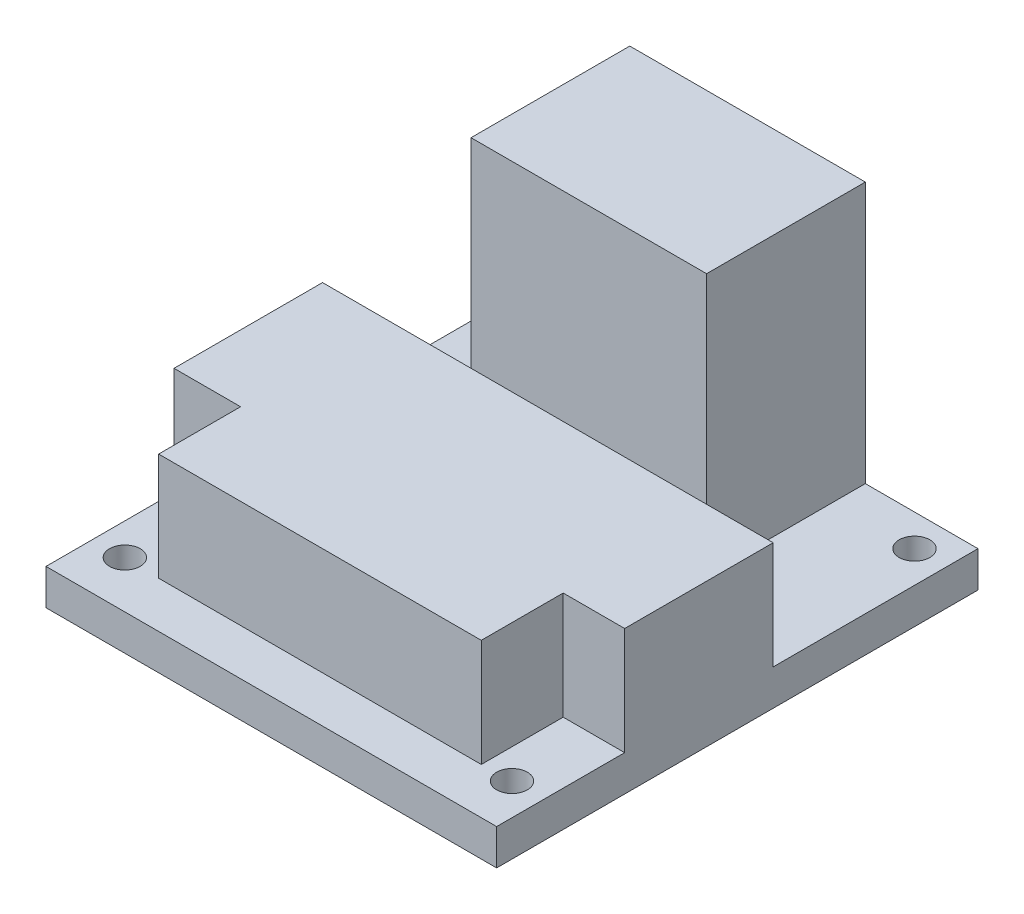
ISO-10303-21;
HEADER;
FILE_DESCRIPTION(('STEP AP214'),'2;1');
FILE_NAME('part.step','',(''),(''),'','','');
FILE_SCHEMA(('AUTOMOTIVE_DESIGN { 1 0 10303 214 1 1 1 1 }'));
ENDSEC;
DATA;
#1=APPLICATION_CONTEXT('core data for automotive mechanical design processes');
#2=APPLICATION_PROTOCOL_DEFINITION('international standard','automotive_design',2000,#1);
#3=PRODUCT_CONTEXT('',#1,'mechanical');
#4=PRODUCT('Part','Part','',(#3));
#5=PRODUCT_RELATED_PRODUCT_CATEGORY('part','',(#4));
#6=PRODUCT_DEFINITION_FORMATION('','',#4);
#7=PRODUCT_DEFINITION_CONTEXT('part definition',#1,'design');
#8=PRODUCT_DEFINITION('design','',#6,#7);
#9=PRODUCT_DEFINITION_SHAPE('','',#8);
#10=(LENGTH_UNIT() NAMED_UNIT(*) SI_UNIT(.MILLI.,.METRE.));
#11=(NAMED_UNIT(*) PLANE_ANGLE_UNIT() SI_UNIT($,.RADIAN.));
#12=(NAMED_UNIT(*) SI_UNIT($,.STERADIAN.) SOLID_ANGLE_UNIT());
#13=UNCERTAINTY_MEASURE_WITH_UNIT(LENGTH_MEASURE(1.E-05),#10,'distance_accuracy_value','');
#14=(GEOMETRIC_REPRESENTATION_CONTEXT(3) GLOBAL_UNCERTAINTY_ASSIGNED_CONTEXT((#13)) GLOBAL_UNIT_ASSIGNED_CONTEXT((#10,
#11,#12)) REPRESENTATION_CONTEXT('',''));
#15=CARTESIAN_POINT('',(0.,0.,0.));
#16=DIRECTION('',(0.,0.,1.));
#17=DIRECTION('',(1.,0.,0.));
#18=AXIS2_PLACEMENT_3D('',#15,#16,#17);
#19=CARTESIAN_POINT('',(0.,3.5,0.));
#20=DIRECTION('',(0.,-1.,0.));
#21=DIRECTION('',(0.,0.,-1.));
#22=AXIS2_PLACEMENT_3D('',#19,#20,#21);
#23=PLANE('',#22);
#24=CARTESIAN_POINT('',(40.9,3.5,-43.9));
#25=DIRECTION('',(0.,-1.,0.));
#26=DIRECTION('',(0.,0.,-1.));
#27=AXIS2_PLACEMENT_3D('',#24,#25,#26);
#28=CIRCLE('',#27,1.5);
#29=CARTESIAN_POINT('',(40.9,3.5,-45.4));
#30=VERTEX_POINT('',#29);
#31=EDGE_CURVE('E257',#30,#30,#28,.T.);
#32=ORIENTED_EDGE('',*,*,#31,.T.);
#33=EDGE_LOOP('',(#32));
#34=FACE_BOUND('',#33,.T.);
#35=CARTESIAN_POINT('',(3.09999999999999,3.5,-43.9));
#36=DIRECTION('',(0.,-1.,0.));
#37=DIRECTION('',(0.,0.,-1.));
#38=AXIS2_PLACEMENT_3D('',#35,#36,#37);
#39=CIRCLE('',#38,1.5);
#40=CARTESIAN_POINT('',(3.09999999999999,3.5,-45.4));
#41=VERTEX_POINT('',#40);
#42=EDGE_CURVE('E253',#41,#41,#39,.T.);
#43=ORIENTED_EDGE('',*,*,#42,.T.);
#44=EDGE_LOOP('',(#43));
#45=FACE_BOUND('',#44,.T.);
#46=DIRECTION('',(0.,0.,1.));
#47=VECTOR('',#46,1.);
#48=CARTESIAN_POINT('',(9.99999999999999,3.5,-47.));
#49=LINE('',#48,#47);
#50=CARTESIAN_POINT('',(9.99999999999999,3.5,-47.));
#51=VERTEX_POINT('',#50);
#52=CARTESIAN_POINT('',(9.99999999999999,3.5,-31.5));
#53=VERTEX_POINT('',#52);
#54=EDGE_CURVE('E290',#51,#53,#49,.T.);
#55=ORIENTED_EDGE('',*,*,#54,.F.);
#56=DIRECTION('',(-1.,0.,0.));
#57=VECTOR('',#56,1.);
#58=CARTESIAN_POINT('',(0.,3.5,-47.));
#59=LINE('',#58,#57);
#60=CARTESIAN_POINT('',(0.,3.5,-47.));
#61=VERTEX_POINT('',#60);
#62=EDGE_CURVE('E222',#51,#61,#59,.T.);
#63=ORIENTED_EDGE('',*,*,#62,.T.);
#64=DIRECTION('',(0.,0.,1.));
#65=VECTOR('',#64,1.);
#66=CARTESIAN_POINT('',(0.,3.5,0.));
#67=LINE('',#66,#65);
#68=CARTESIAN_POINT('',(0.,3.5,-27.));
#69=VERTEX_POINT('',#68);
#70=EDGE_CURVE('E211',#61,#69,#67,.T.);
#71=ORIENTED_EDGE('',*,*,#70,.T.);
#72=DIRECTION('',(-1.,0.,0.));
#73=VECTOR('',#72,1.);
#74=CARTESIAN_POINT('',(0.,3.5,-27.));
#75=LINE('',#74,#73);
#76=CARTESIAN_POINT('',(44.,3.5,-27.));
#77=VERTEX_POINT('',#76);
#78=EDGE_CURVE('E187',#77,#69,#75,.T.);
#79=ORIENTED_EDGE('',*,*,#78,.F.);
#80=DIRECTION('',(0.,0.,-1.));
#81=VECTOR('',#80,1.);
#82=CARTESIAN_POINT('',(44.,3.5,0.));
#83=LINE('',#82,#81);
#84=CARTESIAN_POINT('',(44.,3.5,-47.));
#85=VERTEX_POINT('',#84);
#86=EDGE_CURVE('E218',#77,#85,#83,.T.);
#87=ORIENTED_EDGE('',*,*,#86,.T.);
#88=CARTESIAN_POINT('',(33.,3.5,-47.));
#89=VERTEX_POINT('',#88);
#90=EDGE_CURVE('E223',#85,#89,#59,.T.);
#91=ORIENTED_EDGE('',*,*,#90,.T.);
#92=DIRECTION('',(0.,0.,-1.));
#93=VECTOR('',#92,1.);
#94=CARTESIAN_POINT('',(33.,3.5,-47.));
#95=LINE('',#94,#93);
#96=CARTESIAN_POINT('',(33.,3.5,-31.5));
#97=VERTEX_POINT('',#96);
#98=EDGE_CURVE('E316',#97,#89,#95,.T.);
#99=ORIENTED_EDGE('',*,*,#98,.F.);
#100=DIRECTION('',(1.,0.,0.));
#101=VECTOR('',#100,1.);
#102=CARTESIAN_POINT('',(9.99999999999999,3.5,-31.5));
#103=LINE('',#102,#101);
#104=EDGE_CURVE('E329',#53,#97,#103,.T.);
#105=ORIENTED_EDGE('',*,*,#104,.F.);
#106=EDGE_LOOP('',(#55,#63,#71,#79,#87,#91,#99,#105));
#107=FACE_BOUND('',#106,.T.);
#108=ADVANCED_FACE('F45',(#34,#45,#107),#23,.F.);
#109=CARTESIAN_POINT('',(3.09999999999999,3.5,-4.6));
#110=DIRECTION('',(0.,-1.,0.));
#111=DIRECTION('',(0.,0.,-1.));
#112=AXIS2_PLACEMENT_3D('',#109,#110,#111);
#113=CIRCLE('',#112,1.50000000000154);
#114=CARTESIAN_POINT('',(3.09999999999999,3.5,-6.10000000000154));
#115=VERTEX_POINT('',#114);
#116=EDGE_CURVE('E274',#115,#115,#113,.T.);
#117=ORIENTED_EDGE('',*,*,#116,.T.);
#118=EDGE_LOOP('',(#117));
#119=FACE_BOUND('',#118,.T.);
#120=CARTESIAN_POINT('',(40.9,3.5,-4.6));
#121=DIRECTION('',(0.,-1.,0.));
#122=DIRECTION('',(0.,0.,-1.));
#123=AXIS2_PLACEMENT_3D('',#120,#121,#122);
#124=CIRCLE('',#123,1.5);
#125=CARTESIAN_POINT('',(40.9,3.5,-6.1));
#126=VERTEX_POINT('',#125);
#127=EDGE_CURVE('E261',#126,#126,#124,.T.);
#128=ORIENTED_EDGE('',*,*,#127,.T.);
#129=EDGE_LOOP('',(#128));
#130=FACE_BOUND('',#129,.T.);
#131=DIRECTION('',(1.,0.,0.));
#132=VECTOR('',#131,1.);
#133=CARTESIAN_POINT('',(0.,3.5,-4.5));
#134=LINE('',#133,#132);
#135=CARTESIAN_POINT('',(6.5,3.5,-4.5));
#136=VERTEX_POINT('',#135);
#137=CARTESIAN_POINT('',(38.,3.5,-4.5));
#138=VERTEX_POINT('',#137);
#139=EDGE_CURVE('E176',#136,#138,#134,.T.);
#140=ORIENTED_EDGE('',*,*,#139,.F.);
#141=DIRECTION('',(0.,0.,-1.));
#142=VECTOR('',#141,1.);
#143=CARTESIAN_POINT('',(6.5,3.5,-4.5));
#144=LINE('',#143,#142);
#145=CARTESIAN_POINT('',(6.5,3.5,-12.5));
#146=VERTEX_POINT('',#145);
#147=EDGE_CURVE('E161',#136,#146,#144,.T.);
#148=ORIENTED_EDGE('',*,*,#147,.T.);
#149=DIRECTION('',(-1.,0.,0.));
#150=VECTOR('',#149,1.);
#151=CARTESIAN_POINT('',(0.,3.5,-12.5));
#152=LINE('',#151,#150);
#153=CARTESIAN_POINT('',(0.,3.5,-12.5));
#154=VERTEX_POINT('',#153);
#155=EDGE_CURVE('E283',#146,#154,#152,.T.);
#156=ORIENTED_EDGE('',*,*,#155,.T.);
#157=CARTESIAN_POINT('',(0.,3.5,0.));
#158=VERTEX_POINT('',#157);
#159=EDGE_CURVE('E215',#154,#158,#67,.T.);
#160=ORIENTED_EDGE('',*,*,#159,.T.);
#161=DIRECTION('',(1.,0.,0.));
#162=VECTOR('',#161,1.);
#163=CARTESIAN_POINT('',(0.,3.5,0.));
#164=LINE('',#163,#162);
#165=CARTESIAN_POINT('',(44.,3.5,0.));
#166=VERTEX_POINT('',#165);
#167=EDGE_CURVE('E214',#158,#166,#164,.T.);
#168=ORIENTED_EDGE('',*,*,#167,.T.);
#169=CARTESIAN_POINT('',(44.,3.5,-12.5));
#170=VERTEX_POINT('',#169);
#171=EDGE_CURVE('E219',#166,#170,#83,.T.);
#172=ORIENTED_EDGE('',*,*,#171,.T.);
#173=DIRECTION('',(-1.,0.,0.));
#174=VECTOR('',#173,1.);
#175=CARTESIAN_POINT('',(44.,3.5,-12.5));
#176=LINE('',#175,#174);
#177=CARTESIAN_POINT('',(38.,3.5,-12.5));
#178=VERTEX_POINT('',#177);
#179=EDGE_CURVE('E299',#170,#178,#176,.T.);
#180=ORIENTED_EDGE('',*,*,#179,.T.);
#181=DIRECTION('',(0.,0.,1.));
#182=VECTOR('',#181,1.);
#183=CARTESIAN_POINT('',(38.,3.5,-4.5));
#184=LINE('',#183,#182);
#185=EDGE_CURVE('E185',#178,#138,#184,.T.);
#186=ORIENTED_EDGE('',*,*,#185,.T.);
#187=EDGE_LOOP('',(#140,#148,#156,#160,#168,#172,#180,#186));
#188=FACE_BOUND('',#187,.T.);
#189=ADVANCED_FACE('F183',(#119,#130,#188),#23,.F.);
#190=CARTESIAN_POINT('',(0.,3.5,0.));
#191=DIRECTION('',(1.,0.,0.));
#192=DIRECTION('',(0.,0.,-1.));
#193=AXIS2_PLACEMENT_3D('',#190,#191,#192);
#194=PLANE('',#193);
#195=ORIENTED_EDGE('',*,*,#159,.F.);
#196=DIRECTION('',(0.,1.,0.));
#197=VECTOR('',#196,1.);
#198=CARTESIAN_POINT('',(0.,-6.80776406404416,-12.5));
#199=LINE('',#198,#197);
#200=CARTESIAN_POINT('',(0.,14.,-12.5));
#201=VERTEX_POINT('',#200);
#202=EDGE_CURVE('E285',#154,#201,#199,.T.);
#203=ORIENTED_EDGE('',*,*,#202,.T.);
#204=DIRECTION('',(0.,0.,1.));
#205=VECTOR('',#204,1.);
#206=CARTESIAN_POINT('',(0.,14.,-4.5));
#207=LINE('',#206,#205);
#208=CARTESIAN_POINT('',(0.,14.,-27.));
#209=VERTEX_POINT('',#208);
#210=EDGE_CURVE('E193',#209,#201,#207,.T.);
#211=ORIENTED_EDGE('',*,*,#210,.F.);
#212=DIRECTION('',(0.,-1.,0.));
#213=VECTOR('',#212,1.);
#214=CARTESIAN_POINT('',(0.,14.,-27.));
#215=LINE('',#214,#213);
#216=EDGE_CURVE('E202',#209,#69,#215,.T.);
#217=ORIENTED_EDGE('',*,*,#216,.T.);
#218=ORIENTED_EDGE('',*,*,#70,.F.);
#219=DIRECTION('',(0.,-1.,0.));
#220=VECTOR('',#219,1.);
#221=CARTESIAN_POINT('',(0.,3.5,-47.));
#222=LINE('',#221,#220);
#223=CARTESIAN_POINT('',(0.,0.,-47.));
#224=VERTEX_POINT('',#223);
#225=EDGE_CURVE('E226',#61,#224,#222,.T.);
#226=ORIENTED_EDGE('',*,*,#225,.T.);
#227=DIRECTION('',(0.,0.,1.));
#228=VECTOR('',#227,1.);
#229=CARTESIAN_POINT('',(0.,0.,0.));
#230=LINE('',#229,#228);
#231=CARTESIAN_POINT('',(0.,0.,0.));
#232=VERTEX_POINT('',#231);
#233=EDGE_CURVE('E210',#224,#232,#230,.T.);
#234=ORIENTED_EDGE('',*,*,#233,.T.);
#235=DIRECTION('',(0.,-1.,0.));
#236=VECTOR('',#235,1.);
#237=CARTESIAN_POINT('',(0.,3.5,0.));
#238=LINE('',#237,#236);
#239=EDGE_CURVE('E11',#158,#232,#238,.T.);
#240=ORIENTED_EDGE('',*,*,#239,.F.);
#241=EDGE_LOOP('',(#195,#203,#211,#217,#218,#226,#234,#240));
#242=FACE_BOUND('',#241,.T.);
#243=ADVANCED_FACE('F47',(#242),#194,.F.);
#244=CARTESIAN_POINT('',(0.,3.5,0.));
#245=DIRECTION('',(0.,0.,-1.));
#246=DIRECTION('',(-1.,0.,0.));
#247=AXIS2_PLACEMENT_3D('',#244,#245,#246);
#248=PLANE('',#247);
#249=DIRECTION('',(1.,0.,0.));
#250=VECTOR('',#249,1.);
#251=CARTESIAN_POINT('',(0.,0.,0.));
#252=LINE('',#251,#250);
#253=CARTESIAN_POINT('',(44.,0.,0.));
#254=VERTEX_POINT('',#253);
#255=EDGE_CURVE('E230',#232,#254,#252,.T.);
#256=ORIENTED_EDGE('',*,*,#255,.T.);
#257=DIRECTION('',(0.,-1.,0.));
#258=VECTOR('',#257,1.);
#259=CARTESIAN_POINT('',(44.,3.5,0.));
#260=LINE('',#259,#258);
#261=EDGE_CURVE('E55',#166,#254,#260,.T.);
#262=ORIENTED_EDGE('',*,*,#261,.F.);
#263=ORIENTED_EDGE('',*,*,#167,.F.);
#264=ORIENTED_EDGE('',*,*,#239,.T.);
#265=EDGE_LOOP('',(#256,#262,#263,#264));
#266=FACE_BOUND('',#265,.T.);
#267=ADVANCED_FACE('F373',(#266),#248,.F.);
#268=CARTESIAN_POINT('',(44.,3.5,0.));
#269=DIRECTION('',(-1.,0.,0.));
#270=DIRECTION('',(0.,0.,1.));
#271=AXIS2_PLACEMENT_3D('',#268,#269,#270);
#272=PLANE('',#271);
#273=DIRECTION('',(0.,1.,0.));
#274=VECTOR('',#273,1.);
#275=CARTESIAN_POINT('',(44.,-6.80776406404416,-12.5));
#276=LINE('',#275,#274);
#277=CARTESIAN_POINT('',(44.,14.,-12.5));
#278=VERTEX_POINT('',#277);
#279=EDGE_CURVE('E278',#170,#278,#276,.T.);
#280=ORIENTED_EDGE('',*,*,#279,.F.);
#281=ORIENTED_EDGE('',*,*,#171,.F.);
#282=ORIENTED_EDGE('',*,*,#261,.T.);
#283=DIRECTION('',(0.,0.,-1.));
#284=VECTOR('',#283,1.);
#285=CARTESIAN_POINT('',(44.,0.,0.));
#286=LINE('',#285,#284);
#287=CARTESIAN_POINT('',(44.,0.,-47.));
#288=VERTEX_POINT('',#287);
#289=EDGE_CURVE('E233',#254,#288,#286,.T.);
#290=ORIENTED_EDGE('',*,*,#289,.T.);
#291=DIRECTION('',(0.,-1.,0.));
#292=VECTOR('',#291,1.);
#293=CARTESIAN_POINT('',(44.,3.5,-47.));
#294=LINE('',#293,#292);
#295=EDGE_CURVE('E242',#85,#288,#294,.T.);
#296=ORIENTED_EDGE('',*,*,#295,.F.);
#297=ORIENTED_EDGE('',*,*,#86,.F.);
#298=DIRECTION('',(0.,-1.,0.));
#299=VECTOR('',#298,1.);
#300=CARTESIAN_POINT('',(44.,14.,-27.));
#301=LINE('',#300,#299);
#302=CARTESIAN_POINT('',(44.,14.,-27.));
#303=VERTEX_POINT('',#302);
#304=EDGE_CURVE('E206',#303,#77,#301,.T.);
#305=ORIENTED_EDGE('',*,*,#304,.F.);
#306=DIRECTION('',(0.,0.,-1.));
#307=VECTOR('',#306,1.);
#308=CARTESIAN_POINT('',(44.,14.,-4.5));
#309=LINE('',#308,#307);
#310=EDGE_CURVE('E350',#278,#303,#309,.T.);
#311=ORIENTED_EDGE('',*,*,#310,.F.);
#312=EDGE_LOOP('',(#280,#281,#282,#290,#296,#297,#305,#311));
#313=FACE_BOUND('',#312,.T.);
#314=ADVANCED_FACE('F383',(#313),#272,.F.);
#315=CARTESIAN_POINT('',(0.,3.5,-47.));
#316=DIRECTION('',(0.,0.,1.));
#317=DIRECTION('',(1.,0.,0.));
#318=AXIS2_PLACEMENT_3D('',#315,#316,#317);
#319=PLANE('',#318);
#320=DIRECTION('',(-1.,0.,0.));
#321=VECTOR('',#320,1.);
#322=CARTESIAN_POINT('',(0.,0.,-47.));
#323=LINE('',#322,#321);
#324=EDGE_CURVE('E236',#288,#224,#323,.T.);
#325=ORIENTED_EDGE('',*,*,#324,.T.);
#326=ORIENTED_EDGE('',*,*,#225,.F.);
#327=ORIENTED_EDGE('',*,*,#62,.F.);
#328=DIRECTION('',(0.,-1.,0.));
#329=VECTOR('',#328,1.);
#330=CARTESIAN_POINT('',(9.99999999999999,29.,-47.));
#331=LINE('',#330,#329);
#332=CARTESIAN_POINT('',(9.99999999999999,29.,-47.));
#333=VERTEX_POINT('',#332);
#334=EDGE_CURVE('E325',#333,#51,#331,.T.);
#335=ORIENTED_EDGE('',*,*,#334,.F.);
#336=DIRECTION('',(-1.,0.,0.));
#337=VECTOR('',#336,1.);
#338=CARTESIAN_POINT('',(9.99999999999999,29.,-47.));
#339=LINE('',#338,#337);
#340=CARTESIAN_POINT('',(33.,29.,-47.));
#341=VERTEX_POINT('',#340);
#342=EDGE_CURVE('E322',#341,#333,#339,.T.);
#343=ORIENTED_EDGE('',*,*,#342,.F.);
#344=DIRECTION('',(0.,-1.,0.));
#345=VECTOR('',#344,1.);
#346=CARTESIAN_POINT('',(33.,29.,-47.));
#347=LINE('',#346,#345);
#348=EDGE_CURVE('E339',#341,#89,#347,.T.);
#349=ORIENTED_EDGE('',*,*,#348,.T.);
#350=ORIENTED_EDGE('',*,*,#90,.F.);
#351=ORIENTED_EDGE('',*,*,#295,.T.);
#352=EDGE_LOOP('',(#325,#326,#327,#335,#343,#349,#350,#351));
#353=FACE_BOUND('',#352,.T.);
#354=ADVANCED_FACE('F398',(#353),#319,.F.);
#355=CARTESIAN_POINT('',(0.,0.,0.));
#356=DIRECTION('',(0.,-1.,0.));
#357=DIRECTION('',(0.,0.,-1.));
#358=AXIS2_PLACEMENT_3D('',#355,#356,#357);
#359=PLANE('',#358);
#360=CARTESIAN_POINT('',(3.09999999999999,0.,-4.6));
#361=DIRECTION('',(0.,-1.,0.));
#362=DIRECTION('',(0.,0.,-1.));
#363=AXIS2_PLACEMENT_3D('',#360,#361,#362);
#364=CIRCLE('',#363,1.50000000000154);
#365=CARTESIAN_POINT('',(3.09999999999999,0.,-6.10000000000154));
#366=VERTEX_POINT('',#365);
#367=EDGE_CURVE('E49',#366,#366,#364,.T.);
#368=ORIENTED_EDGE('',*,*,#367,.F.);
#369=EDGE_LOOP('',(#368));
#370=FACE_BOUND('',#369,.T.);
#371=CARTESIAN_POINT('',(40.9,0.,-4.6));
#372=DIRECTION('',(0.,-1.,0.));
#373=DIRECTION('',(0.,0.,-1.));
#374=AXIS2_PLACEMENT_3D('',#371,#372,#373);
#375=CIRCLE('',#374,1.5);
#376=CARTESIAN_POINT('',(40.9,0.,-6.1));
#377=VERTEX_POINT('',#376);
#378=EDGE_CURVE('E258',#377,#377,#375,.T.);
#379=ORIENTED_EDGE('',*,*,#378,.F.);
#380=EDGE_LOOP('',(#379));
#381=FACE_BOUND('',#380,.T.);
#382=CARTESIAN_POINT('',(40.9,0.,-43.9));
#383=DIRECTION('',(0.,-1.,0.));
#384=DIRECTION('',(0.,0.,-1.));
#385=AXIS2_PLACEMENT_3D('',#382,#383,#384);
#386=CIRCLE('',#385,1.5);
#387=CARTESIAN_POINT('',(40.9,0.,-45.4));
#388=VERTEX_POINT('',#387);
#389=EDGE_CURVE('E254',#388,#388,#386,.T.);
#390=ORIENTED_EDGE('',*,*,#389,.F.);
#391=EDGE_LOOP('',(#390));
#392=FACE_BOUND('',#391,.T.);
#393=CARTESIAN_POINT('',(3.09999999999999,0.,-43.9));
#394=DIRECTION('',(0.,-1.,0.));
#395=DIRECTION('',(0.,0.,-1.));
#396=AXIS2_PLACEMENT_3D('',#393,#394,#395);
#397=CIRCLE('',#396,1.5);
#398=CARTESIAN_POINT('',(3.09999999999999,0.,-45.4));
#399=VERTEX_POINT('',#398);
#400=EDGE_CURVE('E249',#399,#399,#397,.T.);
#401=ORIENTED_EDGE('',*,*,#400,.F.);
#402=EDGE_LOOP('',(#401));
#403=FACE_BOUND('',#402,.T.);
#404=ORIENTED_EDGE('',*,*,#233,.F.);
#405=ORIENTED_EDGE('',*,*,#324,.F.);
#406=ORIENTED_EDGE('',*,*,#289,.F.);
#407=ORIENTED_EDGE('',*,*,#255,.F.);
#408=EDGE_LOOP('',(#404,#405,#406,#407));
#409=FACE_BOUND('',#408,.T.);
#410=ADVANCED_FACE('F379',(#370,#381,#392,#403,#409),#359,.T.);
#411=CARTESIAN_POINT('',(0.,14.,-4.5));
#412=DIRECTION('',(0.,0.,-1.));
#413=DIRECTION('',(-1.,0.,0.));
#414=AXIS2_PLACEMENT_3D('',#411,#412,#413);
#415=PLANE('',#414);
#416=DIRECTION('',(1.,0.,0.));
#417=VECTOR('',#416,1.);
#418=CARTESIAN_POINT('',(0.,14.,-4.5));
#419=LINE('',#418,#417);
#420=CARTESIAN_POINT('',(6.5,14.,-4.5));
#421=VERTEX_POINT('',#420);
#422=CARTESIAN_POINT('',(38.,14.,-4.5));
#423=VERTEX_POINT('',#422);
#424=EDGE_CURVE('E178',#421,#423,#419,.T.);
#425=ORIENTED_EDGE('',*,*,#424,.F.);
#426=DIRECTION('',(0.,1.,0.));
#427=VECTOR('',#426,1.);
#428=CARTESIAN_POINT('',(6.5,-6.80776406404416,-4.5));
#429=LINE('',#428,#427);
#430=EDGE_CURVE('E164',#136,#421,#429,.T.);
#431=ORIENTED_EDGE('',*,*,#430,.F.);
#432=ORIENTED_EDGE('',*,*,#139,.T.);
#433=DIRECTION('',(0.,1.,0.));
#434=VECTOR('',#433,1.);
#435=CARTESIAN_POINT('',(38.,-6.80776406404416,-4.5));
#436=LINE('',#435,#434);
#437=EDGE_CURVE('E295',#138,#423,#436,.T.);
#438=ORIENTED_EDGE('',*,*,#437,.T.);
#439=EDGE_LOOP('',(#425,#431,#432,#438));
#440=FACE_BOUND('',#439,.T.);
#441=ADVANCED_FACE('F174',(#440),#415,.F.);
#442=CARTESIAN_POINT('',(0.,14.,-27.));
#443=DIRECTION('',(0.,0.,1.));
#444=DIRECTION('',(1.,0.,0.));
#445=AXIS2_PLACEMENT_3D('',#442,#443,#444);
#446=PLANE('',#445);
#447=ORIENTED_EDGE('',*,*,#78,.T.);
#448=ORIENTED_EDGE('',*,*,#216,.F.);
#449=DIRECTION('',(-1.,0.,0.));
#450=VECTOR('',#449,1.);
#451=CARTESIAN_POINT('',(0.,14.,-27.));
#452=LINE('',#451,#450);
#453=EDGE_CURVE('E199',#303,#209,#452,.T.);
#454=ORIENTED_EDGE('',*,*,#453,.F.);
#455=ORIENTED_EDGE('',*,*,#304,.T.);
#456=EDGE_LOOP('',(#447,#448,#454,#455));
#457=FACE_BOUND('',#456,.T.);
#458=ADVANCED_FACE('F362',(#457),#446,.F.);
#459=CARTESIAN_POINT('',(0.,14.,0.));
#460=DIRECTION('',(0.,-1.,0.));
#461=DIRECTION('',(0.,0.,-1.));
#462=AXIS2_PLACEMENT_3D('',#459,#460,#461);
#463=PLANE('',#462);
#464=DIRECTION('',(-1.,0.,0.));
#465=VECTOR('',#464,1.);
#466=CARTESIAN_POINT('',(0.,14.,-12.5));
#467=LINE('',#466,#465);
#468=CARTESIAN_POINT('',(6.5,14.,-12.5));
#469=VERTEX_POINT('',#468);
#470=EDGE_CURVE('E180',#469,#201,#467,.T.);
#471=ORIENTED_EDGE('',*,*,#470,.F.);
#472=DIRECTION('',(0.,0.,-1.));
#473=VECTOR('',#472,1.);
#474=CARTESIAN_POINT('',(6.5,14.,-4.5));
#475=LINE('',#474,#473);
#476=EDGE_CURVE('E63',#421,#469,#475,.T.);
#477=ORIENTED_EDGE('',*,*,#476,.F.);
#478=ORIENTED_EDGE('',*,*,#424,.T.);
#479=DIRECTION('',(0.,0.,1.));
#480=VECTOR('',#479,1.);
#481=CARTESIAN_POINT('',(38.,14.,-4.5));
#482=LINE('',#481,#480);
#483=CARTESIAN_POINT('',(38.,14.,-12.5));
#484=VERTEX_POINT('',#483);
#485=EDGE_CURVE('E306',#484,#423,#482,.T.);
#486=ORIENTED_EDGE('',*,*,#485,.F.);
#487=DIRECTION('',(-1.,0.,0.));
#488=VECTOR('',#487,1.);
#489=CARTESIAN_POINT('',(44.,14.,-12.5));
#490=LINE('',#489,#488);
#491=EDGE_CURVE('E71',#278,#484,#490,.T.);
#492=ORIENTED_EDGE('',*,*,#491,.F.);
#493=ORIENTED_EDGE('',*,*,#310,.T.);
#494=ORIENTED_EDGE('',*,*,#453,.T.);
#495=ORIENTED_EDGE('',*,*,#210,.T.);
#496=EDGE_LOOP('',(#471,#477,#478,#486,#492,#493,#494,#495));
#497=FACE_BOUND('',#496,.T.);
#498=ADVANCED_FACE('F359',(#497),#463,.F.);
#499=CARTESIAN_POINT('',(9.99999999999999,29.,-47.));
#500=DIRECTION('',(1.,0.,0.));
#501=DIRECTION('',(0.,0.,-1.));
#502=AXIS2_PLACEMENT_3D('',#499,#500,#501);
#503=PLANE('',#502);
#504=ORIENTED_EDGE('',*,*,#54,.T.);
#505=DIRECTION('',(0.,-1.,0.));
#506=VECTOR('',#505,1.);
#507=CARTESIAN_POINT('',(9.99999999999999,29.,-31.5));
#508=LINE('',#507,#506);
#509=CARTESIAN_POINT('',(9.99999999999999,29.,-31.5));
#510=VERTEX_POINT('',#509);
#511=EDGE_CURVE('E188',#510,#53,#508,.T.);
#512=ORIENTED_EDGE('',*,*,#511,.F.);
#513=DIRECTION('',(0.,0.,1.));
#514=VECTOR('',#513,1.);
#515=CARTESIAN_POINT('',(9.99999999999999,29.,-47.));
#516=LINE('',#515,#514);
#517=EDGE_CURVE('E311',#333,#510,#516,.T.);
#518=ORIENTED_EDGE('',*,*,#517,.F.);
#519=ORIENTED_EDGE('',*,*,#334,.T.);
#520=EDGE_LOOP('',(#504,#512,#518,#519));
#521=FACE_BOUND('',#520,.T.);
#522=ADVANCED_FACE('F410',(#521),#503,.F.);
#523=CARTESIAN_POINT('',(9.99999999999999,29.,-31.5));
#524=DIRECTION('',(0.,0.,-1.));
#525=DIRECTION('',(-1.,0.,0.));
#526=AXIS2_PLACEMENT_3D('',#523,#524,#525);
#527=PLANE('',#526);
#528=ORIENTED_EDGE('',*,*,#104,.T.);
#529=DIRECTION('',(0.,-1.,0.));
#530=VECTOR('',#529,1.);
#531=CARTESIAN_POINT('',(33.,29.,-31.5));
#532=LINE('',#531,#530);
#533=CARTESIAN_POINT('',(33.,29.,-31.5));
#534=VERTEX_POINT('',#533);
#535=EDGE_CURVE('E196',#534,#97,#532,.T.);
#536=ORIENTED_EDGE('',*,*,#535,.F.);
#537=DIRECTION('',(1.,0.,0.));
#538=VECTOR('',#537,1.);
#539=CARTESIAN_POINT('',(9.99999999999999,29.,-31.5));
#540=LINE('',#539,#538);
#541=EDGE_CURVE('E315',#510,#534,#540,.T.);
#542=ORIENTED_EDGE('',*,*,#541,.F.);
#543=ORIENTED_EDGE('',*,*,#511,.T.);
#544=EDGE_LOOP('',(#528,#536,#542,#543));
#545=FACE_BOUND('',#544,.T.);
#546=ADVANCED_FACE('F406',(#545),#527,.F.);
#547=CARTESIAN_POINT('',(33.,29.,-47.));
#548=DIRECTION('',(-1.,0.,0.));
#549=DIRECTION('',(0.,0.,1.));
#550=AXIS2_PLACEMENT_3D('',#547,#548,#549);
#551=PLANE('',#550);
#552=ORIENTED_EDGE('',*,*,#98,.T.);
#553=ORIENTED_EDGE('',*,*,#348,.F.);
#554=DIRECTION('',(0.,0.,-1.));
#555=VECTOR('',#554,1.);
#556=CARTESIAN_POINT('',(33.,29.,-47.));
#557=LINE('',#556,#555);
#558=EDGE_CURVE('E319',#534,#341,#557,.T.);
#559=ORIENTED_EDGE('',*,*,#558,.F.);
#560=ORIENTED_EDGE('',*,*,#535,.T.);
#561=EDGE_LOOP('',(#552,#553,#559,#560));
#562=FACE_BOUND('',#561,.T.);
#563=ADVANCED_FACE('F402',(#562),#551,.F.);
#564=CARTESIAN_POINT('',(0.,29.,0.));
#565=DIRECTION('',(0.,1.,0.));
#566=DIRECTION('',(0.,0.,1.));
#567=AXIS2_PLACEMENT_3D('',#564,#565,#566);
#568=PLANE('',#567);
#569=ORIENTED_EDGE('',*,*,#517,.T.);
#570=ORIENTED_EDGE('',*,*,#541,.T.);
#571=ORIENTED_EDGE('',*,*,#558,.T.);
#572=ORIENTED_EDGE('',*,*,#342,.T.);
#573=EDGE_LOOP('',(#569,#570,#571,#572));
#574=FACE_BOUND('',#573,.T.);
#575=ADVANCED_FACE('F412',(#574),#568,.T.);
#576=CARTESIAN_POINT('',(44.,-6.80776406404416,-12.5));
#577=DIRECTION('',(0.,0.,-1.));
#578=DIRECTION('',(-1.,0.,0.));
#579=AXIS2_PLACEMENT_3D('',#576,#577,#578);
#580=PLANE('',#579);
#581=ORIENTED_EDGE('',*,*,#279,.T.);
#582=ORIENTED_EDGE('',*,*,#491,.T.);
#583=DIRECTION('',(0.,1.,0.));
#584=VECTOR('',#583,1.);
#585=CARTESIAN_POINT('',(38.,-6.80776406404416,-12.5));
#586=LINE('',#585,#584);
#587=EDGE_CURVE('E296',#178,#484,#586,.T.);
#588=ORIENTED_EDGE('',*,*,#587,.F.);
#589=ORIENTED_EDGE('',*,*,#179,.F.);
#590=EDGE_LOOP('',(#581,#582,#588,#589));
#591=FACE_BOUND('',#590,.T.);
#592=ADVANCED_FACE('F386',(#591),#580,.F.);
#593=CARTESIAN_POINT('',(38.,-6.80776406404416,-4.5));
#594=DIRECTION('',(-1.,0.,0.));
#595=DIRECTION('',(0.,0.,1.));
#596=AXIS2_PLACEMENT_3D('',#593,#594,#595);
#597=PLANE('',#596);
#598=ORIENTED_EDGE('',*,*,#587,.T.);
#599=ORIENTED_EDGE('',*,*,#485,.T.);
#600=ORIENTED_EDGE('',*,*,#437,.F.);
#601=ORIENTED_EDGE('',*,*,#185,.F.);
#602=EDGE_LOOP('',(#598,#599,#600,#601));
#603=FACE_BOUND('',#602,.T.);
#604=ADVANCED_FACE('F389',(#603),#597,.F.);
#605=CARTESIAN_POINT('',(6.5,-6.80776406404416,-4.5));
#606=DIRECTION('',(1.,0.,0.));
#607=DIRECTION('',(0.,0.,-1.));
#608=AXIS2_PLACEMENT_3D('',#605,#606,#607);
#609=PLANE('',#608);
#610=ORIENTED_EDGE('',*,*,#430,.T.);
#611=ORIENTED_EDGE('',*,*,#476,.T.);
#612=DIRECTION('',(0.,1.,0.));
#613=VECTOR('',#612,1.);
#614=CARTESIAN_POINT('',(6.5,-6.80776406404416,-12.5));
#615=LINE('',#614,#613);
#616=EDGE_CURVE('E165',#146,#469,#615,.T.);
#617=ORIENTED_EDGE('',*,*,#616,.F.);
#618=ORIENTED_EDGE('',*,*,#147,.F.);
#619=EDGE_LOOP('',(#610,#611,#617,#618));
#620=FACE_BOUND('',#619,.T.);
#621=ADVANCED_FACE('F163',(#620),#609,.F.);
#622=CARTESIAN_POINT('',(0.,-6.80776406404416,-12.5));
#623=DIRECTION('',(0.,0.,-1.));
#624=DIRECTION('',(-1.,0.,0.));
#625=AXIS2_PLACEMENT_3D('',#622,#623,#624);
#626=PLANE('',#625);
#627=ORIENTED_EDGE('',*,*,#616,.T.);
#628=ORIENTED_EDGE('',*,*,#470,.T.);
#629=ORIENTED_EDGE('',*,*,#202,.F.);
#630=ORIENTED_EDGE('',*,*,#155,.F.);
#631=EDGE_LOOP('',(#627,#628,#629,#630));
#632=FACE_BOUND('',#631,.T.);
#633=ADVANCED_FACE('F368',(#632),#626,.F.);
#634=CARTESIAN_POINT('',(3.09999999999999,-1.2E-05,-43.9));
#635=DIRECTION('',(0.,1.,0.));
#636=DIRECTION('',(0.,0.,1.));
#637=AXIS2_PLACEMENT_3D('',#634,#635,#636);
#638=CYLINDRICAL_SURFACE('',#637,1.5);
#639=ORIENTED_EDGE('',*,*,#400,.T.);
#640=EDGE_LOOP('',(#639));
#641=FACE_BOUND('',#640,.T.);
#642=ORIENTED_EDGE('',*,*,#42,.F.);
#643=EDGE_LOOP('',(#642));
#644=FACE_BOUND('',#643,.T.);
#645=ADVANCED_FACE('F490',(#641,#644),#638,.F.);
#646=CARTESIAN_POINT('',(40.9,-1.2E-05,-43.9));
#647=DIRECTION('',(0.,1.,0.));
#648=DIRECTION('',(0.,0.,1.));
#649=AXIS2_PLACEMENT_3D('',#646,#647,#648);
#650=CYLINDRICAL_SURFACE('',#649,1.5);
#651=ORIENTED_EDGE('',*,*,#389,.T.);
#652=EDGE_LOOP('',(#651));
#653=FACE_BOUND('',#652,.T.);
#654=ORIENTED_EDGE('',*,*,#31,.F.);
#655=EDGE_LOOP('',(#654));
#656=FACE_BOUND('',#655,.T.);
#657=ADVANCED_FACE('F502',(#653,#656),#650,.F.);
#658=CARTESIAN_POINT('',(40.9,-1.2E-05,-4.6));
#659=DIRECTION('',(0.,1.,0.));
#660=DIRECTION('',(0.,0.,1.));
#661=AXIS2_PLACEMENT_3D('',#658,#659,#660);
#662=CYLINDRICAL_SURFACE('',#661,1.5);
#663=ORIENTED_EDGE('',*,*,#378,.T.);
#664=EDGE_LOOP('',(#663));
#665=FACE_BOUND('',#664,.T.);
#666=ORIENTED_EDGE('',*,*,#127,.F.);
#667=EDGE_LOOP('',(#666));
#668=FACE_BOUND('',#667,.T.);
#669=ADVANCED_FACE('F512',(#665,#668),#662,.F.);
#670=CARTESIAN_POINT('',(3.09999999999999,-1.2E-05,-4.6));
#671=DIRECTION('',(0.,1.,0.));
#672=DIRECTION('',(0.,0.,1.));
#673=AXIS2_PLACEMENT_3D('',#670,#671,#672);
#674=CYLINDRICAL_SURFACE('',#673,1.50000000000154);
#675=ORIENTED_EDGE('',*,*,#367,.T.);
#676=EDGE_LOOP('',(#675));
#677=FACE_BOUND('',#676,.T.);
#678=ORIENTED_EDGE('',*,*,#116,.F.);
#679=EDGE_LOOP('',(#678));
#680=FACE_BOUND('',#679,.T.);
#681=ADVANCED_FACE('F522',(#677,#680),#674,.F.);
#682=CLOSED_SHELL('',(#108,#189,#243,#267,#314,#354,#410,#441,#458,#498,#522,#546,#563,#575,
#592,#604,#621,#633,#645,#657,#669,#681));
#683=MANIFOLD_SOLID_BREP('B2',#682);
#684=ADVANCED_BREP_SHAPE_REPRESENTATION('',(#18,#683),#14);
#685=SHAPE_DEFINITION_REPRESENTATION(#9,#684);
ENDSEC;
END-ISO-10303-21;
